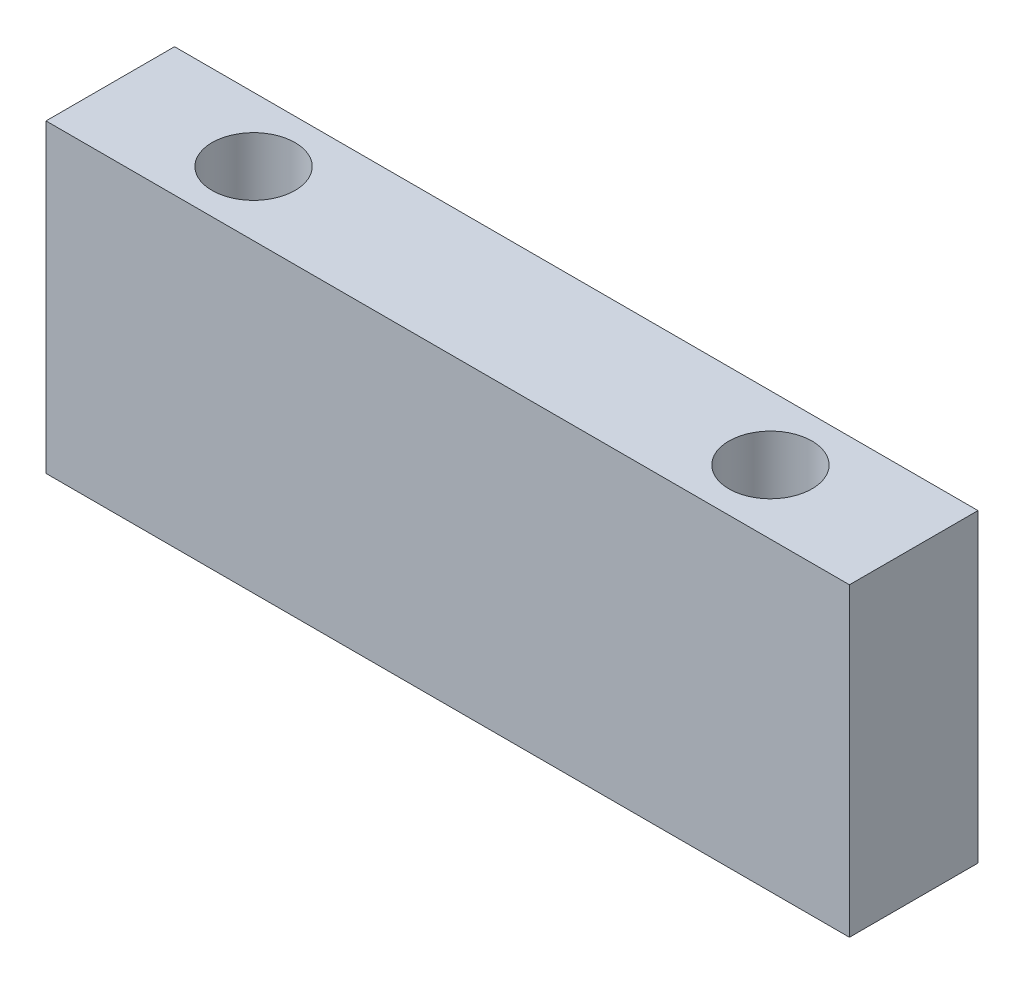
ISO-10303-21;
HEADER;
FILE_DESCRIPTION(('STEP AP214'),'2;1');
FILE_NAME('part.step','',(''),(''),'','','');
FILE_SCHEMA(('AUTOMOTIVE_DESIGN { 1 0 10303 214 1 1 1 1 }'));
ENDSEC;
DATA;
#1=APPLICATION_CONTEXT('core data for automotive mechanical design processes');
#2=APPLICATION_PROTOCOL_DEFINITION('international standard','automotive_design',2000,#1);
#3=PRODUCT_CONTEXT('',#1,'mechanical');
#4=PRODUCT('Part','Part','',(#3));
#5=PRODUCT_RELATED_PRODUCT_CATEGORY('part','',(#4));
#6=PRODUCT_DEFINITION_FORMATION('','',#4);
#7=PRODUCT_DEFINITION_CONTEXT('part definition',#1,'design');
#8=PRODUCT_DEFINITION('design','',#6,#7);
#9=PRODUCT_DEFINITION_SHAPE('','',#8);
#10=(LENGTH_UNIT() NAMED_UNIT(*) SI_UNIT(.MILLI.,.METRE.));
#11=(NAMED_UNIT(*) PLANE_ANGLE_UNIT() SI_UNIT($,.RADIAN.));
#12=(NAMED_UNIT(*) SI_UNIT($,.STERADIAN.) SOLID_ANGLE_UNIT());
#13=UNCERTAINTY_MEASURE_WITH_UNIT(LENGTH_MEASURE(1.E-05),#10,'distance_accuracy_value','');
#14=(GEOMETRIC_REPRESENTATION_CONTEXT(3) GLOBAL_UNCERTAINTY_ASSIGNED_CONTEXT((#13)) GLOBAL_UNIT_ASSIGNED_CONTEXT((#10,
#11,#12)) REPRESENTATION_CONTEXT('',''));
#15=CARTESIAN_POINT('',(0.,0.,0.));
#16=DIRECTION('',(0.,0.,1.));
#17=DIRECTION('',(1.,0.,0.));
#18=AXIS2_PLACEMENT_3D('',#15,#16,#17);
#19=CARTESIAN_POINT('',(0.,28.956,12.192));
#20=DIRECTION('',(1.,0.,0.));
#21=DIRECTION('',(0.,0.,-1.));
#22=AXIS2_PLACEMENT_3D('',#19,#20,#21);
#23=PLANE('',#22);
#24=DIRECTION('',(0.,-1.,0.));
#25=VECTOR('',#24,1.);
#26=CARTESIAN_POINT('',(0.,28.956,0.));
#27=LINE('',#26,#25);
#28=CARTESIAN_POINT('',(0.,28.956,0.));
#29=VERTEX_POINT('',#28);
#30=CARTESIAN_POINT('',(0.,0.,0.));
#31=VERTEX_POINT('',#30);
#32=EDGE_CURVE('E96',#29,#31,#27,.T.);
#33=ORIENTED_EDGE('',*,*,#32,.T.);
#34=DIRECTION('',(0.,0.,-1.));
#35=VECTOR('',#34,1.);
#36=CARTESIAN_POINT('',(0.,0.,12.192));
#37=LINE('',#36,#35);
#38=CARTESIAN_POINT('',(0.,0.,12.192));
#39=VERTEX_POINT('',#38);
#40=EDGE_CURVE('E11',#39,#31,#37,.T.);
#41=ORIENTED_EDGE('',*,*,#40,.F.);
#42=DIRECTION('',(0.,-1.,0.));
#43=VECTOR('',#42,1.);
#44=CARTESIAN_POINT('',(0.,28.956,12.192));
#45=LINE('',#44,#43);
#46=CARTESIAN_POINT('',(0.,28.956,12.192));
#47=VERTEX_POINT('',#46);
#48=EDGE_CURVE('E84',#47,#39,#45,.T.);
#49=ORIENTED_EDGE('',*,*,#48,.F.);
#50=DIRECTION('',(0.,0.,-1.));
#51=VECTOR('',#50,1.);
#52=CARTESIAN_POINT('',(0.,28.956,12.192));
#53=LINE('',#52,#51);
#54=EDGE_CURVE('E92',#47,#29,#53,.T.);
#55=ORIENTED_EDGE('',*,*,#54,.T.);
#56=EDGE_LOOP('',(#33,#41,#49,#55));
#57=FACE_BOUND('',#56,.T.);
#58=ADVANCED_FACE('F33',(#57),#23,.F.);
#59=CARTESIAN_POINT('',(0.,0.,12.192));
#60=DIRECTION('',(0.,1.,0.));
#61=DIRECTION('',(0.,0.,1.));
#62=AXIS2_PLACEMENT_3D('',#59,#60,#61);
#63=PLANE('',#62);
#64=CARTESIAN_POINT('',(13.589,0.,6.096));
#65=DIRECTION('',(0.,1.,0.));
#66=DIRECTION('',(-1.,0.,0.));
#67=AXIS2_PLACEMENT_3D('',#64,#65,#66);
#68=CIRCLE('',#67,3.937);
#69=CARTESIAN_POINT('',(9.652,0.,6.096));
#70=VERTEX_POINT('',#69);
#71=EDGE_CURVE('E113',#70,#70,#68,.T.);
#72=ORIENTED_EDGE('',*,*,#71,.T.);
#73=EDGE_LOOP('',(#72));
#74=FACE_BOUND('',#73,.T.);
#75=CARTESIAN_POINT('',(62.611,0.,6.096));
#76=DIRECTION('',(0.,1.,0.));
#77=DIRECTION('',(-1.,0.,0.));
#78=AXIS2_PLACEMENT_3D('',#75,#76,#77);
#79=CIRCLE('',#78,3.937);
#80=CARTESIAN_POINT('',(58.674,0.,6.096));
#81=VERTEX_POINT('',#80);
#82=EDGE_CURVE('E99',#81,#81,#79,.T.);
#83=ORIENTED_EDGE('',*,*,#82,.T.);
#84=EDGE_LOOP('',(#83));
#85=FACE_BOUND('',#84,.T.);
#86=DIRECTION('',(1.,0.,0.));
#87=VECTOR('',#86,1.);
#88=CARTESIAN_POINT('',(0.,0.,0.));
#89=LINE('',#88,#87);
#90=CARTESIAN_POINT('',(76.2,0.,0.));
#91=VERTEX_POINT('',#90);
#92=EDGE_CURVE('E88',#31,#91,#89,.T.);
#93=ORIENTED_EDGE('',*,*,#92,.T.);
#94=DIRECTION('',(0.,0.,-1.));
#95=VECTOR('',#94,1.);
#96=CARTESIAN_POINT('',(76.2,0.,12.192));
#97=LINE('',#96,#95);
#98=CARTESIAN_POINT('',(76.2,0.,12.192));
#99=VERTEX_POINT('',#98);
#100=EDGE_CURVE('E41',#99,#91,#97,.T.);
#101=ORIENTED_EDGE('',*,*,#100,.F.);
#102=DIRECTION('',(1.,0.,0.));
#103=VECTOR('',#102,1.);
#104=CARTESIAN_POINT('',(0.,0.,12.192));
#105=LINE('',#104,#103);
#106=EDGE_CURVE('E79',#39,#99,#105,.T.);
#107=ORIENTED_EDGE('',*,*,#106,.F.);
#108=ORIENTED_EDGE('',*,*,#40,.T.);
#109=EDGE_LOOP('',(#93,#101,#107,#108));
#110=FACE_BOUND('',#109,.T.);
#111=ADVANCED_FACE('F87',(#74,#85,#110),#63,.F.);
#112=CARTESIAN_POINT('',(76.2,0.,12.192));
#113=DIRECTION('',(-1.,0.,0.));
#114=DIRECTION('',(0.,0.,1.));
#115=AXIS2_PLACEMENT_3D('',#112,#113,#114);
#116=PLANE('',#115);
#117=DIRECTION('',(0.,1.,0.));
#118=VECTOR('',#117,1.);
#119=CARTESIAN_POINT('',(76.2,0.,0.));
#120=LINE('',#119,#118);
#121=CARTESIAN_POINT('',(76.2,28.956,0.));
#122=VERTEX_POINT('',#121);
#123=EDGE_CURVE('E66',#91,#122,#120,.T.);
#124=ORIENTED_EDGE('',*,*,#123,.T.);
#125=DIRECTION('',(0.,0.,-1.));
#126=VECTOR('',#125,1.);
#127=CARTESIAN_POINT('',(76.2,28.956,12.192));
#128=LINE('',#127,#126);
#129=CARTESIAN_POINT('',(76.2,28.956,12.192));
#130=VERTEX_POINT('',#129);
#131=EDGE_CURVE('E89',#130,#122,#128,.T.);
#132=ORIENTED_EDGE('',*,*,#131,.F.);
#133=DIRECTION('',(0.,1.,0.));
#134=VECTOR('',#133,1.);
#135=CARTESIAN_POINT('',(76.2,0.,12.192));
#136=LINE('',#135,#134);
#137=EDGE_CURVE('E82',#99,#130,#136,.T.);
#138=ORIENTED_EDGE('',*,*,#137,.F.);
#139=ORIENTED_EDGE('',*,*,#100,.T.);
#140=EDGE_LOOP('',(#124,#132,#138,#139));
#141=FACE_BOUND('',#140,.T.);
#142=ADVANCED_FACE('F90',(#141),#116,.F.);
#143=CARTESIAN_POINT('',(76.2,28.956,12.192));
#144=DIRECTION('',(0.,-1.,0.));
#145=DIRECTION('',(1.,0.,0.));
#146=AXIS2_PLACEMENT_3D('',#143,#144,#145);
#147=PLANE('',#146);
#148=CARTESIAN_POINT('',(13.589,28.956,6.096));
#149=DIRECTION('',(0.,1.,0.));
#150=DIRECTION('',(-1.,0.,0.));
#151=AXIS2_PLACEMENT_3D('',#148,#149,#150);
#152=CIRCLE('',#151,3.937);
#153=CARTESIAN_POINT('',(9.652,28.956,6.096));
#154=VERTEX_POINT('',#153);
#155=EDGE_CURVE('E116',#154,#154,#152,.T.);
#156=ORIENTED_EDGE('',*,*,#155,.F.);
#157=EDGE_LOOP('',(#156));
#158=FACE_BOUND('',#157,.T.);
#159=CARTESIAN_POINT('',(62.611,28.956,6.096));
#160=DIRECTION('',(0.,1.,0.));
#161=DIRECTION('',(-1.,0.,0.));
#162=AXIS2_PLACEMENT_3D('',#159,#160,#161);
#163=CIRCLE('',#162,3.937);
#164=CARTESIAN_POINT('',(58.674,28.956,6.096));
#165=VERTEX_POINT('',#164);
#166=EDGE_CURVE('E110',#165,#165,#163,.T.);
#167=ORIENTED_EDGE('',*,*,#166,.F.);
#168=EDGE_LOOP('',(#167));
#169=FACE_BOUND('',#168,.T.);
#170=DIRECTION('',(-1.,0.,0.));
#171=VECTOR('',#170,1.);
#172=CARTESIAN_POINT('',(76.2,28.956,0.));
#173=LINE('',#172,#171);
#174=EDGE_CURVE('E72',#122,#29,#173,.T.);
#175=ORIENTED_EDGE('',*,*,#174,.T.);
#176=ORIENTED_EDGE('',*,*,#54,.F.);
#177=DIRECTION('',(-1.,0.,0.));
#178=VECTOR('',#177,1.);
#179=CARTESIAN_POINT('',(76.2,28.956,12.192));
#180=LINE('',#179,#178);
#181=EDGE_CURVE('E49',#130,#47,#180,.T.);
#182=ORIENTED_EDGE('',*,*,#181,.F.);
#183=ORIENTED_EDGE('',*,*,#131,.T.);
#184=EDGE_LOOP('',(#175,#176,#182,#183));
#185=FACE_BOUND('',#184,.T.);
#186=ADVANCED_FACE('F104',(#158,#169,#185),#147,.F.);
#187=CARTESIAN_POINT('',(0.,0.,12.192));
#188=DIRECTION('',(0.,0.,1.));
#189=DIRECTION('',(1.,0.,0.));
#190=AXIS2_PLACEMENT_3D('',#187,#188,#189);
#191=PLANE('',#190);
#192=ORIENTED_EDGE('',*,*,#48,.T.);
#193=ORIENTED_EDGE('',*,*,#106,.T.);
#194=ORIENTED_EDGE('',*,*,#137,.T.);
#195=ORIENTED_EDGE('',*,*,#181,.T.);
#196=EDGE_LOOP('',(#192,#193,#194,#195));
#197=FACE_BOUND('',#196,.T.);
#198=ADVANCED_FACE('F80',(#197),#191,.T.);
#199=CARTESIAN_POINT('',(0.,0.,0.));
#200=DIRECTION('',(0.,0.,1.));
#201=DIRECTION('',(1.,0.,0.));
#202=AXIS2_PLACEMENT_3D('',#199,#200,#201);
#203=PLANE('',#202);
#204=ORIENTED_EDGE('',*,*,#32,.F.);
#205=ORIENTED_EDGE('',*,*,#174,.F.);
#206=ORIENTED_EDGE('',*,*,#123,.F.);
#207=ORIENTED_EDGE('',*,*,#92,.F.);
#208=EDGE_LOOP('',(#204,#205,#206,#207));
#209=FACE_BOUND('',#208,.T.);
#210=ADVANCED_FACE('F107',(#209),#203,.F.);
#211=CARTESIAN_POINT('',(62.611,0.,6.096));
#212=DIRECTION('',(0.,1.,0.));
#213=DIRECTION('',(-1.,0.,0.));
#214=AXIS2_PLACEMENT_3D('',#211,#212,#213);
#215=CYLINDRICAL_SURFACE('',#214,3.937);
#216=ORIENTED_EDGE('',*,*,#82,.F.);
#217=EDGE_LOOP('',(#216));
#218=FACE_BOUND('',#217,.T.);
#219=ORIENTED_EDGE('',*,*,#166,.T.);
#220=EDGE_LOOP('',(#219));
#221=FACE_BOUND('',#220,.T.);
#222=ADVANCED_FACE('F127',(#218,#221),#215,.F.);
#223=CARTESIAN_POINT('',(13.589,0.,6.096));
#224=DIRECTION('',(0.,1.,0.));
#225=DIRECTION('',(-1.,0.,0.));
#226=AXIS2_PLACEMENT_3D('',#223,#224,#225);
#227=CYLINDRICAL_SURFACE('',#226,3.937);
#228=ORIENTED_EDGE('',*,*,#71,.F.);
#229=EDGE_LOOP('',(#228));
#230=FACE_BOUND('',#229,.T.);
#231=ORIENTED_EDGE('',*,*,#155,.T.);
#232=EDGE_LOOP('',(#231));
#233=FACE_BOUND('',#232,.T.);
#234=ADVANCED_FACE('F124',(#230,#233),#227,.F.);
#235=CLOSED_SHELL('',(#58,#111,#142,#186,#198,#210,#222,#234));
#236=MANIFOLD_SOLID_BREP('B2',#235);
#237=ADVANCED_BREP_SHAPE_REPRESENTATION('',(#18,#236),#14);
#238=SHAPE_DEFINITION_REPRESENTATION(#9,#237);
ENDSEC;
END-ISO-10303-21;
